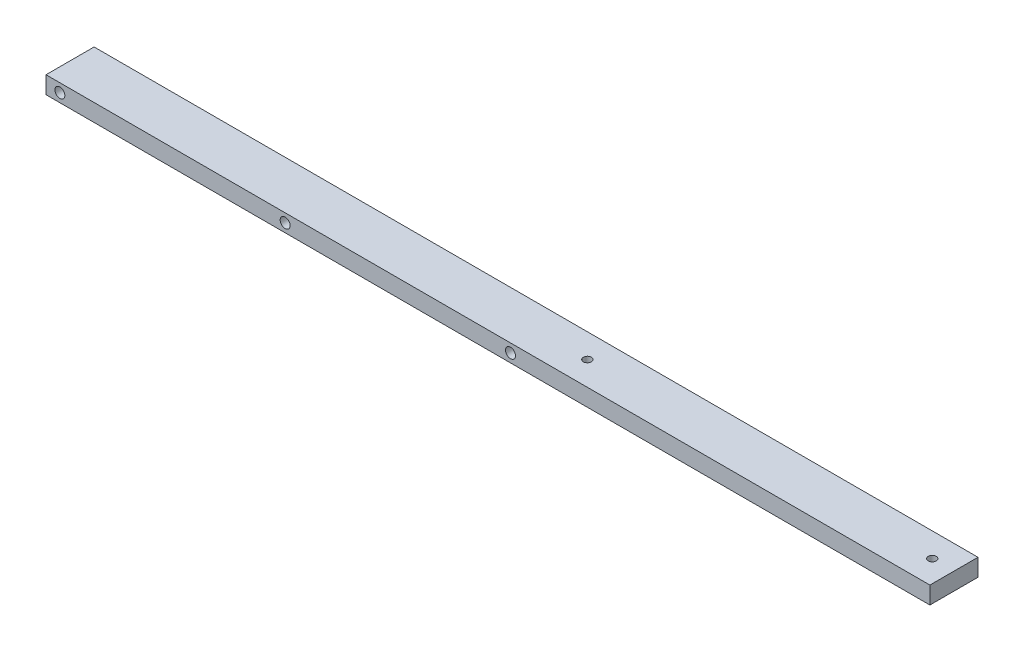
ISO-10303-21;
HEADER;
FILE_DESCRIPTION(('STEP AP214'),'2;1');
FILE_NAME('part.step','',(''),(''),'','','');
FILE_SCHEMA(('AUTOMOTIVE_DESIGN { 1 0 10303 214 1 1 1 1 }'));
ENDSEC;
DATA;
#1=APPLICATION_CONTEXT('core data for automotive mechanical design processes');
#2=APPLICATION_PROTOCOL_DEFINITION('international standard','automotive_design',2000,#1);
#3=PRODUCT_CONTEXT('',#1,'mechanical');
#4=PRODUCT('Part','Part','',(#3));
#5=PRODUCT_RELATED_PRODUCT_CATEGORY('part','',(#4));
#6=PRODUCT_DEFINITION_FORMATION('','',#4);
#7=PRODUCT_DEFINITION_CONTEXT('part definition',#1,'design');
#8=PRODUCT_DEFINITION('design','',#6,#7);
#9=PRODUCT_DEFINITION_SHAPE('','',#8);
#10=(LENGTH_UNIT() NAMED_UNIT(*) SI_UNIT(.MILLI.,.METRE.));
#11=(NAMED_UNIT(*) PLANE_ANGLE_UNIT() SI_UNIT($,.RADIAN.));
#12=(NAMED_UNIT(*) SI_UNIT($,.STERADIAN.) SOLID_ANGLE_UNIT());
#13=UNCERTAINTY_MEASURE_WITH_UNIT(LENGTH_MEASURE(1.E-05),#10,'distance_accuracy_value','');
#14=(GEOMETRIC_REPRESENTATION_CONTEXT(3) GLOBAL_UNCERTAINTY_ASSIGNED_CONTEXT((#13)) GLOBAL_UNIT_ASSIGNED_CONTEXT((#10,
#11,#12)) REPRESENTATION_CONTEXT('',''));
#15=CARTESIAN_POINT('',(0.,0.,0.));
#16=DIRECTION('',(0.,0.,1.));
#17=DIRECTION('',(1.,0.,0.));
#18=AXIS2_PLACEMENT_3D('',#15,#16,#17);
#19=CARTESIAN_POINT('',(323.85,0.,0.));
#20=DIRECTION('',(0.,0.,-1.));
#21=DIRECTION('',(-1.,0.,0.));
#22=AXIS2_PLACEMENT_3D('',#19,#20,#21);
#23=PLANE('',#22);
#24=CARTESIAN_POINT('',(5.08,3.17499999999996,0.));
#25=DIRECTION('',(0.,0.,1.));
#26=DIRECTION('',(1.,0.,0.));
#27=AXIS2_PLACEMENT_3D('',#24,#25,#26);
#28=CIRCLE('',#27,1.8288);
#29=CARTESIAN_POINT('',(6.9088,3.17499999999996,0.));
#30=VERTEX_POINT('',#29);
#31=EDGE_CURVE('E128',#30,#30,#28,.T.);
#32=ORIENTED_EDGE('',*,*,#31,.F.);
#33=EDGE_LOOP('',(#32));
#34=FACE_BOUND('',#33,.T.);
#35=CARTESIAN_POINT('',(87.63,3.17499999999996,0.));
#36=DIRECTION('',(0.,0.,1.));
#37=DIRECTION('',(1.,0.,0.));
#38=AXIS2_PLACEMENT_3D('',#35,#36,#37);
#39=CIRCLE('',#38,1.82879999999999);
#40=CARTESIAN_POINT('',(89.4588,3.17499999999996,0.));
#41=VERTEX_POINT('',#40);
#42=EDGE_CURVE('E122',#41,#41,#39,.T.);
#43=ORIENTED_EDGE('',*,*,#42,.F.);
#44=EDGE_LOOP('',(#43));
#45=FACE_BOUND('',#44,.T.);
#46=CARTESIAN_POINT('',(170.18,3.17499999999996,0.));
#47=DIRECTION('',(0.,0.,1.));
#48=DIRECTION('',(1.,0.,0.));
#49=AXIS2_PLACEMENT_3D('',#46,#47,#48);
#50=CIRCLE('',#49,1.82879999999999);
#51=CARTESIAN_POINT('',(172.0088,3.17499999999996,0.));
#52=VERTEX_POINT('',#51);
#53=EDGE_CURVE('E116',#52,#52,#50,.T.);
#54=ORIENTED_EDGE('',*,*,#53,.F.);
#55=EDGE_LOOP('',(#54));
#56=FACE_BOUND('',#55,.T.);
#57=DIRECTION('',(0.,-1.,0.));
#58=VECTOR('',#57,1.);
#59=CARTESIAN_POINT('',(0.,0.,0.));
#60=LINE('',#59,#58);
#61=CARTESIAN_POINT('',(0.,6.35,0.));
#62=VERTEX_POINT('',#61);
#63=CARTESIAN_POINT('',(0.,0.,0.));
#64=VERTEX_POINT('',#63);
#65=EDGE_CURVE('E100',#62,#64,#60,.T.);
#66=ORIENTED_EDGE('',*,*,#65,.T.);
#67=DIRECTION('',(-1.,0.,0.));
#68=VECTOR('',#67,1.);
#69=CARTESIAN_POINT('',(323.85,0.,0.));
#70=LINE('',#69,#68);
#71=CARTESIAN_POINT('',(323.85,0.,0.));
#72=VERTEX_POINT('',#71);
#73=EDGE_CURVE('E11',#72,#64,#70,.T.);
#74=ORIENTED_EDGE('',*,*,#73,.F.);
#75=DIRECTION('',(0.,-1.,0.));
#76=VECTOR('',#75,1.);
#77=CARTESIAN_POINT('',(323.85,0.,0.));
#78=LINE('',#77,#76);
#79=CARTESIAN_POINT('',(323.85,6.35,0.));
#80=VERTEX_POINT('',#79);
#81=EDGE_CURVE('E88',#80,#72,#78,.T.);
#82=ORIENTED_EDGE('',*,*,#81,.F.);
#83=DIRECTION('',(-1.,0.,0.));
#84=VECTOR('',#83,1.);
#85=CARTESIAN_POINT('',(323.85,6.35,0.));
#86=LINE('',#85,#84);
#87=EDGE_CURVE('E96',#80,#62,#86,.T.);
#88=ORIENTED_EDGE('',*,*,#87,.T.);
#89=EDGE_LOOP('',(#66,#74,#82,#88));
#90=FACE_BOUND('',#89,.T.);
#91=ADVANCED_FACE('F37',(#34,#45,#56,#90),#23,.F.);
#92=CARTESIAN_POINT('',(323.85,0.,0.));
#93=DIRECTION('',(0.,1.,0.));
#94=DIRECTION('',(0.,0.,1.));
#95=AXIS2_PLACEMENT_3D('',#92,#93,#94);
#96=PLANE('',#95);
#97=CARTESIAN_POINT('',(315.9125,0.,-8.8138));
#98=DIRECTION('',(0.,-1.,0.));
#99=DIRECTION('',(0.,0.,-1.));
#100=AXIS2_PLACEMENT_3D('',#97,#98,#99);
#101=CIRCLE('',#100,2.40029999999997);
#102=CARTESIAN_POINT('',(315.9125,0.,-11.2141));
#103=VERTEX_POINT('',#102);
#104=EDGE_CURVE('E152',#103,#103,#101,.T.);
#105=ORIENTED_EDGE('',*,*,#104,.F.);
#106=EDGE_LOOP('',(#105));
#107=FACE_BOUND('',#106,.T.);
#108=CARTESIAN_POINT('',(189.5475,0.,-8.8138));
#109=DIRECTION('',(0.,-1.,0.));
#110=DIRECTION('',(0.,0.,-1.));
#111=AXIS2_PLACEMENT_3D('',#108,#109,#110);
#112=CIRCLE('',#111,2.40029999999999);
#113=CARTESIAN_POINT('',(189.5475,0.,-11.2141));
#114=VERTEX_POINT('',#113);
#115=EDGE_CURVE('E140',#114,#114,#112,.T.);
#116=ORIENTED_EDGE('',*,*,#115,.F.);
#117=EDGE_LOOP('',(#116));
#118=FACE_BOUND('',#117,.T.);
#119=DIRECTION('',(0.,0.,-1.));
#120=VECTOR('',#119,1.);
#121=CARTESIAN_POINT('',(0.,0.,0.));
#122=LINE('',#121,#120);
#123=CARTESIAN_POINT('',(0.,0.,-17.6276));
#124=VERTEX_POINT('',#123);
#125=EDGE_CURVE('E92',#64,#124,#122,.T.);
#126=ORIENTED_EDGE('',*,*,#125,.T.);
#127=DIRECTION('',(-1.,0.,0.));
#128=VECTOR('',#127,1.);
#129=CARTESIAN_POINT('',(323.85,0.,-17.6276));
#130=LINE('',#129,#128);
#131=CARTESIAN_POINT('',(323.85,0.,-17.6276));
#132=VERTEX_POINT('',#131);
#133=EDGE_CURVE('E45',#132,#124,#130,.T.);
#134=ORIENTED_EDGE('',*,*,#133,.F.);
#135=DIRECTION('',(0.,0.,-1.));
#136=VECTOR('',#135,1.);
#137=CARTESIAN_POINT('',(323.85,0.,0.));
#138=LINE('',#137,#136);
#139=EDGE_CURVE('E83',#72,#132,#138,.T.);
#140=ORIENTED_EDGE('',*,*,#139,.F.);
#141=ORIENTED_EDGE('',*,*,#73,.T.);
#142=EDGE_LOOP('',(#126,#134,#140,#141));
#143=FACE_BOUND('',#142,.T.);
#144=ADVANCED_FACE('F91',(#107,#118,#143),#96,.F.);
#145=CARTESIAN_POINT('',(323.85,0.,-17.6276));
#146=DIRECTION('',(0.,0.,1.));
#147=DIRECTION('',(1.,0.,0.));
#148=AXIS2_PLACEMENT_3D('',#145,#146,#147);
#149=PLANE('',#148);
#150=CARTESIAN_POINT('',(5.08,3.17499999999996,-17.6276));
#151=DIRECTION('',(0.,0.,1.));
#152=DIRECTION('',(1.,0.,0.));
#153=AXIS2_PLACEMENT_3D('',#150,#151,#152);
#154=CIRCLE('',#153,1.8288);
#155=CARTESIAN_POINT('',(6.9088,3.17499999999996,-17.6276));
#156=VERTEX_POINT('',#155);
#157=EDGE_CURVE('E125',#156,#156,#154,.T.);
#158=ORIENTED_EDGE('',*,*,#157,.T.);
#159=EDGE_LOOP('',(#158));
#160=FACE_BOUND('',#159,.T.);
#161=CARTESIAN_POINT('',(87.63,3.17499999999996,-17.6276));
#162=DIRECTION('',(0.,0.,1.));
#163=DIRECTION('',(1.,0.,0.));
#164=AXIS2_PLACEMENT_3D('',#161,#162,#163);
#165=CIRCLE('',#164,1.82879999999999);
#166=CARTESIAN_POINT('',(89.4588,3.17499999999996,-17.6276));
#167=VERTEX_POINT('',#166);
#168=EDGE_CURVE('E119',#167,#167,#165,.T.);
#169=ORIENTED_EDGE('',*,*,#168,.T.);
#170=EDGE_LOOP('',(#169));
#171=FACE_BOUND('',#170,.T.);
#172=CARTESIAN_POINT('',(170.18,3.17499999999996,-17.6276));
#173=DIRECTION('',(0.,0.,1.));
#174=DIRECTION('',(1.,0.,0.));
#175=AXIS2_PLACEMENT_3D('',#172,#173,#174);
#176=CIRCLE('',#175,1.82879999999999);
#177=CARTESIAN_POINT('',(172.0088,3.17499999999996,-17.6276));
#178=VERTEX_POINT('',#177);
#179=EDGE_CURVE('E103',#178,#178,#176,.T.);
#180=ORIENTED_EDGE('',*,*,#179,.T.);
#181=EDGE_LOOP('',(#180));
#182=FACE_BOUND('',#181,.T.);
#183=DIRECTION('',(0.,1.,0.));
#184=VECTOR('',#183,1.);
#185=CARTESIAN_POINT('',(0.,0.,-17.6276));
#186=LINE('',#185,#184);
#187=CARTESIAN_POINT('',(0.,6.35,-17.6276));
#188=VERTEX_POINT('',#187);
#189=EDGE_CURVE('E70',#124,#188,#186,.T.);
#190=ORIENTED_EDGE('',*,*,#189,.T.);
#191=DIRECTION('',(-1.,0.,0.));
#192=VECTOR('',#191,1.);
#193=CARTESIAN_POINT('',(323.85,6.35,-17.6276));
#194=LINE('',#193,#192);
#195=CARTESIAN_POINT('',(323.85,6.35,-17.6276));
#196=VERTEX_POINT('',#195);
#197=EDGE_CURVE('E93',#196,#188,#194,.T.);
#198=ORIENTED_EDGE('',*,*,#197,.F.);
#199=DIRECTION('',(0.,1.,0.));
#200=VECTOR('',#199,1.);
#201=CARTESIAN_POINT('',(323.85,0.,-17.6276));
#202=LINE('',#201,#200);
#203=EDGE_CURVE('E86',#132,#196,#202,.T.);
#204=ORIENTED_EDGE('',*,*,#203,.F.);
#205=ORIENTED_EDGE('',*,*,#133,.T.);
#206=EDGE_LOOP('',(#190,#198,#204,#205));
#207=FACE_BOUND('',#206,.T.);
#208=ADVANCED_FACE('F94',(#160,#171,#182,#207),#149,.F.);
#209=CARTESIAN_POINT('',(323.85,6.35,0.));
#210=DIRECTION('',(0.,-1.,0.));
#211=DIRECTION('',(0.,0.,-1.));
#212=AXIS2_PLACEMENT_3D('',#209,#210,#211);
#213=PLANE('',#212);
#214=CARTESIAN_POINT('',(315.9125,6.35,-8.8138));
#215=DIRECTION('',(0.,-1.,0.));
#216=DIRECTION('',(0.,0.,-1.));
#217=AXIS2_PLACEMENT_3D('',#214,#215,#216);
#218=CIRCLE('',#217,1.47320000000001);
#219=CARTESIAN_POINT('',(315.9125,6.35,-10.287));
#220=VERTEX_POINT('',#219);
#221=EDGE_CURVE('E143',#220,#220,#218,.T.);
#222=ORIENTED_EDGE('',*,*,#221,.T.);
#223=EDGE_LOOP('',(#222));
#224=FACE_BOUND('',#223,.T.);
#225=CARTESIAN_POINT('',(189.5475,6.35,-8.8138));
#226=DIRECTION('',(0.,-1.,0.));
#227=DIRECTION('',(0.,0.,-1.));
#228=AXIS2_PLACEMENT_3D('',#225,#226,#227);
#229=CIRCLE('',#228,1.47320000000001);
#230=CARTESIAN_POINT('',(189.5475,6.35,-10.287));
#231=VERTEX_POINT('',#230);
#232=EDGE_CURVE('E131',#231,#231,#229,.T.);
#233=ORIENTED_EDGE('',*,*,#232,.T.);
#234=EDGE_LOOP('',(#233));
#235=FACE_BOUND('',#234,.T.);
#236=DIRECTION('',(0.,0.,1.));
#237=VECTOR('',#236,1.);
#238=CARTESIAN_POINT('',(0.,6.35,0.));
#239=LINE('',#238,#237);
#240=EDGE_CURVE('E76',#188,#62,#239,.T.);
#241=ORIENTED_EDGE('',*,*,#240,.T.);
#242=ORIENTED_EDGE('',*,*,#87,.F.);
#243=DIRECTION('',(0.,0.,1.));
#244=VECTOR('',#243,1.);
#245=CARTESIAN_POINT('',(323.85,6.35,0.));
#246=LINE('',#245,#244);
#247=EDGE_CURVE('E53',#196,#80,#246,.T.);
#248=ORIENTED_EDGE('',*,*,#247,.F.);
#249=ORIENTED_EDGE('',*,*,#197,.T.);
#250=EDGE_LOOP('',(#241,#242,#248,#249));
#251=FACE_BOUND('',#250,.T.);
#252=ADVANCED_FACE('F108',(#224,#235,#251),#213,.F.);
#253=CARTESIAN_POINT('',(323.85,0.,0.));
#254=DIRECTION('',(-1.,0.,0.));
#255=DIRECTION('',(0.,0.,1.));
#256=AXIS2_PLACEMENT_3D('',#253,#254,#255);
#257=PLANE('',#256);
#258=ORIENTED_EDGE('',*,*,#81,.T.);
#259=ORIENTED_EDGE('',*,*,#139,.T.);
#260=ORIENTED_EDGE('',*,*,#203,.T.);
#261=ORIENTED_EDGE('',*,*,#247,.T.);
#262=EDGE_LOOP('',(#258,#259,#260,#261));
#263=FACE_BOUND('',#262,.T.);
#264=ADVANCED_FACE('F84',(#263),#257,.F.);
#265=CARTESIAN_POINT('',(0.,0.,0.));
#266=DIRECTION('',(-1.,0.,0.));
#267=DIRECTION('',(0.,0.,1.));
#268=AXIS2_PLACEMENT_3D('',#265,#266,#267);
#269=PLANE('',#268);
#270=ORIENTED_EDGE('',*,*,#65,.F.);
#271=ORIENTED_EDGE('',*,*,#240,.F.);
#272=ORIENTED_EDGE('',*,*,#189,.F.);
#273=ORIENTED_EDGE('',*,*,#125,.F.);
#274=EDGE_LOOP('',(#270,#271,#272,#273));
#275=FACE_BOUND('',#274,.T.);
#276=ADVANCED_FACE('F111',(#275),#269,.T.);
#277=CARTESIAN_POINT('',(170.18,3.17499999999996,0.));
#278=DIRECTION('',(0.,0.,1.));
#279=DIRECTION('',(1.,0.,0.));
#280=AXIS2_PLACEMENT_3D('',#277,#278,#279);
#281=CYLINDRICAL_SURFACE('',#280,1.82879999999999);
#282=ORIENTED_EDGE('',*,*,#179,.F.);
#283=EDGE_LOOP('',(#282));
#284=FACE_BOUND('',#283,.T.);
#285=ORIENTED_EDGE('',*,*,#53,.T.);
#286=EDGE_LOOP('',(#285));
#287=FACE_BOUND('',#286,.T.);
#288=ADVANCED_FACE('F189',(#284,#287),#281,.F.);
#289=CARTESIAN_POINT('',(87.63,3.17499999999996,0.));
#290=DIRECTION('',(0.,0.,1.));
#291=DIRECTION('',(1.,0.,0.));
#292=AXIS2_PLACEMENT_3D('',#289,#290,#291);
#293=CYLINDRICAL_SURFACE('',#292,1.82879999999999);
#294=ORIENTED_EDGE('',*,*,#168,.F.);
#295=EDGE_LOOP('',(#294));
#296=FACE_BOUND('',#295,.T.);
#297=ORIENTED_EDGE('',*,*,#42,.T.);
#298=EDGE_LOOP('',(#297));
#299=FACE_BOUND('',#298,.T.);
#300=ADVANCED_FACE('F191',(#296,#299),#293,.F.);
#301=CARTESIAN_POINT('',(5.08,3.17499999999996,0.));
#302=DIRECTION('',(0.,0.,1.));
#303=DIRECTION('',(1.,0.,0.));
#304=AXIS2_PLACEMENT_3D('',#301,#302,#303);
#305=CYLINDRICAL_SURFACE('',#304,1.8288);
#306=ORIENTED_EDGE('',*,*,#157,.F.);
#307=EDGE_LOOP('',(#306));
#308=FACE_BOUND('',#307,.T.);
#309=ORIENTED_EDGE('',*,*,#31,.T.);
#310=EDGE_LOOP('',(#309));
#311=FACE_BOUND('',#310,.T.);
#312=ADVANCED_FACE('F198',(#308,#311),#305,.F.);
#313=CARTESIAN_POINT('',(189.5475,0.,-8.8138));
#314=DIRECTION('',(0.,-1.,0.));
#315=DIRECTION('',(0.,0.,-1.));
#316=AXIS2_PLACEMENT_3D('',#313,#314,#315);
#317=CYLINDRICAL_SURFACE('',#316,1.47320000000001);
#318=ORIENTED_EDGE('',*,*,#232,.F.);
#319=EDGE_LOOP('',(#318));
#320=FACE_BOUND('',#319,.T.);
#321=CARTESIAN_POINT('',(189.5475,2.8448,-8.8138));
#322=DIRECTION('',(0.,-1.,0.));
#323=DIRECTION('',(0.,0.,-1.));
#324=AXIS2_PLACEMENT_3D('',#321,#322,#323);
#325=CIRCLE('',#324,1.47320000000001);
#326=CARTESIAN_POINT('',(189.5475,2.8448,-10.287));
#327=VERTEX_POINT('',#326);
#328=EDGE_CURVE('E134',#327,#327,#325,.T.);
#329=ORIENTED_EDGE('',*,*,#328,.T.);
#330=EDGE_LOOP('',(#329));
#331=FACE_BOUND('',#330,.T.);
#332=ADVANCED_FACE('F175',(#320,#331),#317,.F.);
#333=CARTESIAN_POINT('',(191.0207,2.8448,-8.8138));
#334=DIRECTION('',(0.,1.,0.));
#335=DIRECTION('',(0.,0.,1.));
#336=AXIS2_PLACEMENT_3D('',#333,#334,#335);
#337=PLANE('',#336);
#338=ORIENTED_EDGE('',*,*,#328,.F.);
#339=EDGE_LOOP('',(#338));
#340=FACE_BOUND('',#339,.T.);
#341=CARTESIAN_POINT('',(189.5475,2.8448,-8.8138));
#342=DIRECTION('',(0.,-1.,0.));
#343=DIRECTION('',(0.,0.,-1.));
#344=AXIS2_PLACEMENT_3D('',#341,#342,#343);
#345=CIRCLE('',#344,2.40029999999999);
#346=CARTESIAN_POINT('',(189.5475,2.8448,-11.2141));
#347=VERTEX_POINT('',#346);
#348=EDGE_CURVE('E137',#347,#347,#345,.T.);
#349=ORIENTED_EDGE('',*,*,#348,.T.);
#350=EDGE_LOOP('',(#349));
#351=FACE_BOUND('',#350,.T.);
#352=ADVANCED_FACE('F165',(#340,#351),#337,.F.);
#353=CARTESIAN_POINT('',(189.5475,0.,-8.8138));
#354=DIRECTION('',(0.,-1.,0.));
#355=DIRECTION('',(0.,0.,-1.));
#356=AXIS2_PLACEMENT_3D('',#353,#354,#355);
#357=CYLINDRICAL_SURFACE('',#356,2.40029999999999);
#358=ORIENTED_EDGE('',*,*,#348,.F.);
#359=EDGE_LOOP('',(#358));
#360=FACE_BOUND('',#359,.T.);
#361=ORIENTED_EDGE('',*,*,#115,.T.);
#362=EDGE_LOOP('',(#361));
#363=FACE_BOUND('',#362,.T.);
#364=ADVANCED_FACE('F162',(#360,#363),#357,.F.);
#365=CARTESIAN_POINT('',(315.9125,0.,-8.8138));
#366=DIRECTION('',(0.,-1.,0.));
#367=DIRECTION('',(0.,0.,-1.));
#368=AXIS2_PLACEMENT_3D('',#365,#366,#367);
#369=CYLINDRICAL_SURFACE('',#368,1.47320000000001);
#370=ORIENTED_EDGE('',*,*,#221,.F.);
#371=EDGE_LOOP('',(#370));
#372=FACE_BOUND('',#371,.T.);
#373=CARTESIAN_POINT('',(315.9125,2.8448,-8.8138));
#374=DIRECTION('',(0.,-1.,0.));
#375=DIRECTION('',(0.,0.,-1.));
#376=AXIS2_PLACEMENT_3D('',#373,#374,#375);
#377=CIRCLE('',#376,1.47320000000001);
#378=CARTESIAN_POINT('',(315.9125,2.8448,-10.287));
#379=VERTEX_POINT('',#378);
#380=EDGE_CURVE('E146',#379,#379,#377,.T.);
#381=ORIENTED_EDGE('',*,*,#380,.T.);
#382=EDGE_LOOP('',(#381));
#383=FACE_BOUND('',#382,.T.);
#384=ADVANCED_FACE('F164',(#372,#383),#369,.F.);
#385=CARTESIAN_POINT('',(317.3857,2.8448,-8.8138));
#386=DIRECTION('',(0.,1.,0.));
#387=DIRECTION('',(0.,0.,1.));
#388=AXIS2_PLACEMENT_3D('',#385,#386,#387);
#389=PLANE('',#388);
#390=ORIENTED_EDGE('',*,*,#380,.F.);
#391=EDGE_LOOP('',(#390));
#392=FACE_BOUND('',#391,.T.);
#393=CARTESIAN_POINT('',(315.9125,2.8448,-8.8138));
#394=DIRECTION('',(0.,-1.,0.));
#395=DIRECTION('',(0.,0.,-1.));
#396=AXIS2_PLACEMENT_3D('',#393,#394,#395);
#397=CIRCLE('',#396,2.40030000000002);
#398=CARTESIAN_POINT('',(315.9125,2.8448,-11.2141));
#399=VERTEX_POINT('',#398);
#400=EDGE_CURVE('E149',#399,#399,#397,.T.);
#401=ORIENTED_EDGE('',*,*,#400,.T.);
#402=EDGE_LOOP('',(#401));
#403=FACE_BOUND('',#402,.T.);
#404=ADVANCED_FACE('F172',(#392,#403),#389,.F.);
#405=CARTESIAN_POINT('',(315.9125,0.,-8.8138));
#406=DIRECTION('',(0.,-1.,0.));
#407=DIRECTION('',(0.,0.,-1.));
#408=AXIS2_PLACEMENT_3D('',#405,#406,#407);
#409=CYLINDRICAL_SURFACE('',#408,2.40029999999999);
#410=ORIENTED_EDGE('',*,*,#400,.F.);
#411=EDGE_LOOP('',(#410));
#412=FACE_BOUND('',#411,.T.);
#413=ORIENTED_EDGE('',*,*,#104,.T.);
#414=EDGE_LOOP('',(#413));
#415=FACE_BOUND('',#414,.T.);
#416=ADVANCED_FACE('F156',(#412,#415),#409,.F.);
#417=CLOSED_SHELL('',(#91,#144,#208,#252,#264,#276,#288,#300,#312,#332,#352,#364,#384,#404,#416));
#418=MANIFOLD_SOLID_BREP('B2',#417);
#419=ADVANCED_BREP_SHAPE_REPRESENTATION('',(#18,#418),#14);
#420=SHAPE_DEFINITION_REPRESENTATION(#9,#419);
ENDSEC;
END-ISO-10303-21;
